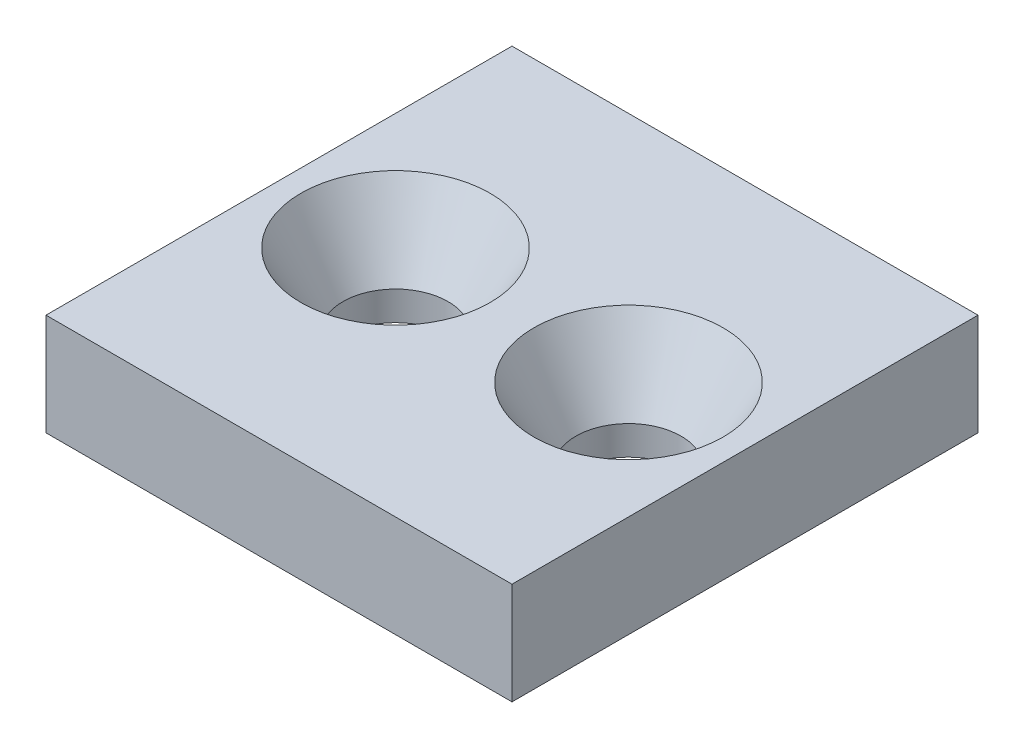
ISO-10303-21;
HEADER;
FILE_DESCRIPTION(('STEP AP214'),'2;1');
FILE_NAME('part.step','',(''),(''),'','','');
FILE_SCHEMA(('AUTOMOTIVE_DESIGN { 1 0 10303 214 1 1 1 1 }'));
ENDSEC;
DATA;
#1=APPLICATION_CONTEXT('core data for automotive mechanical design processes');
#2=APPLICATION_PROTOCOL_DEFINITION('international standard','automotive_design',2000,#1);
#3=PRODUCT_CONTEXT('',#1,'mechanical');
#4=PRODUCT('Part','Part','',(#3));
#5=PRODUCT_RELATED_PRODUCT_CATEGORY('part','',(#4));
#6=PRODUCT_DEFINITION_FORMATION('','',#4);
#7=PRODUCT_DEFINITION_CONTEXT('part definition',#1,'design');
#8=PRODUCT_DEFINITION('design','',#6,#7);
#9=PRODUCT_DEFINITION_SHAPE('','',#8);
#10=(LENGTH_UNIT() NAMED_UNIT(*) SI_UNIT(.MILLI.,.METRE.));
#11=(NAMED_UNIT(*) PLANE_ANGLE_UNIT() SI_UNIT($,.RADIAN.));
#12=(NAMED_UNIT(*) SI_UNIT($,.STERADIAN.) SOLID_ANGLE_UNIT());
#13=UNCERTAINTY_MEASURE_WITH_UNIT(LENGTH_MEASURE(1.E-05),#10,'distance_accuracy_value','');
#14=(GEOMETRIC_REPRESENTATION_CONTEXT(3) GLOBAL_UNCERTAINTY_ASSIGNED_CONTEXT((#13)) GLOBAL_UNIT_ASSIGNED_CONTEXT((#10,
#11,#12)) REPRESENTATION_CONTEXT('',''));
#15=CARTESIAN_POINT('',(0.,0.,0.));
#16=DIRECTION('',(0.,0.,1.));
#17=DIRECTION('',(1.,0.,0.));
#18=AXIS2_PLACEMENT_3D('',#15,#16,#17);
#19=CARTESIAN_POINT('',(16.,3.5,16.));
#20=DIRECTION('',(-1.,0.,0.));
#21=DIRECTION('',(0.,0.,1.));
#22=AXIS2_PLACEMENT_3D('',#19,#20,#21);
#23=PLANE('',#22);
#24=DIRECTION('',(0.,0.,-1.));
#25=VECTOR('',#24,1.);
#26=CARTESIAN_POINT('',(16.,-3.5,16.));
#27=LINE('',#26,#25);
#28=CARTESIAN_POINT('',(16.,-3.5,16.));
#29=VERTEX_POINT('',#28);
#30=CARTESIAN_POINT('',(16.,-3.5,-16.));
#31=VERTEX_POINT('',#30);
#32=EDGE_CURVE('E96',#29,#31,#27,.T.);
#33=ORIENTED_EDGE('',*,*,#32,.T.);
#34=DIRECTION('',(0.,-1.,0.));
#35=VECTOR('',#34,1.);
#36=CARTESIAN_POINT('',(16.,3.5,-16.));
#37=LINE('',#36,#35);
#38=CARTESIAN_POINT('',(16.,3.5,-16.));
#39=VERTEX_POINT('',#38);
#40=EDGE_CURVE('E11',#39,#31,#37,.T.);
#41=ORIENTED_EDGE('',*,*,#40,.F.);
#42=DIRECTION('',(0.,0.,-1.));
#43=VECTOR('',#42,1.);
#44=CARTESIAN_POINT('',(16.,3.5,16.));
#45=LINE('',#44,#43);
#46=CARTESIAN_POINT('',(16.,3.5,16.));
#47=VERTEX_POINT('',#46);
#48=EDGE_CURVE('E84',#47,#39,#45,.T.);
#49=ORIENTED_EDGE('',*,*,#48,.F.);
#50=DIRECTION('',(0.,-1.,0.));
#51=VECTOR('',#50,1.);
#52=CARTESIAN_POINT('',(16.,3.5,16.));
#53=LINE('',#52,#51);
#54=EDGE_CURVE('E92',#47,#29,#53,.T.);
#55=ORIENTED_EDGE('',*,*,#54,.T.);
#56=EDGE_LOOP('',(#33,#41,#49,#55));
#57=FACE_BOUND('',#56,.T.);
#58=ADVANCED_FACE('F33',(#57),#23,.F.);
#59=CARTESIAN_POINT('',(-16.,3.5,-16.));
#60=DIRECTION('',(0.,0.,1.));
#61=DIRECTION('',(1.,0.,0.));
#62=AXIS2_PLACEMENT_3D('',#59,#60,#61);
#63=PLANE('',#62);
#64=DIRECTION('',(-1.,0.,0.));
#65=VECTOR('',#64,1.);
#66=CARTESIAN_POINT('',(-16.,-3.5,-16.));
#67=LINE('',#66,#65);
#68=CARTESIAN_POINT('',(-16.,-3.5,-16.));
#69=VERTEX_POINT('',#68);
#70=EDGE_CURVE('E88',#31,#69,#67,.T.);
#71=ORIENTED_EDGE('',*,*,#70,.T.);
#72=DIRECTION('',(0.,-1.,0.));
#73=VECTOR('',#72,1.);
#74=CARTESIAN_POINT('',(-16.,3.5,-16.));
#75=LINE('',#74,#73);
#76=CARTESIAN_POINT('',(-16.,3.5,-16.));
#77=VERTEX_POINT('',#76);
#78=EDGE_CURVE('E41',#77,#69,#75,.T.);
#79=ORIENTED_EDGE('',*,*,#78,.F.);
#80=DIRECTION('',(-1.,0.,0.));
#81=VECTOR('',#80,1.);
#82=CARTESIAN_POINT('',(-16.,3.5,-16.));
#83=LINE('',#82,#81);
#84=EDGE_CURVE('E79',#39,#77,#83,.T.);
#85=ORIENTED_EDGE('',*,*,#84,.F.);
#86=ORIENTED_EDGE('',*,*,#40,.T.);
#87=EDGE_LOOP('',(#71,#79,#85,#86));
#88=FACE_BOUND('',#87,.T.);
#89=ADVANCED_FACE('F87',(#88),#63,.F.);
#90=CARTESIAN_POINT('',(-16.,3.5,16.));
#91=DIRECTION('',(1.,0.,0.));
#92=DIRECTION('',(0.,0.,-1.));
#93=AXIS2_PLACEMENT_3D('',#90,#91,#92);
#94=PLANE('',#93);
#95=DIRECTION('',(0.,0.,1.));
#96=VECTOR('',#95,1.);
#97=CARTESIAN_POINT('',(-16.,-3.5,16.));
#98=LINE('',#97,#96);
#99=CARTESIAN_POINT('',(-16.,-3.5,16.));
#100=VERTEX_POINT('',#99);
#101=EDGE_CURVE('E66',#69,#100,#98,.T.);
#102=ORIENTED_EDGE('',*,*,#101,.T.);
#103=DIRECTION('',(0.,-1.,0.));
#104=VECTOR('',#103,1.);
#105=CARTESIAN_POINT('',(-16.,3.5,16.));
#106=LINE('',#105,#104);
#107=CARTESIAN_POINT('',(-16.,3.5,16.));
#108=VERTEX_POINT('',#107);
#109=EDGE_CURVE('E89',#108,#100,#106,.T.);
#110=ORIENTED_EDGE('',*,*,#109,.F.);
#111=DIRECTION('',(0.,0.,1.));
#112=VECTOR('',#111,1.);
#113=CARTESIAN_POINT('',(-16.,3.5,16.));
#114=LINE('',#113,#112);
#115=EDGE_CURVE('E82',#77,#108,#114,.T.);
#116=ORIENTED_EDGE('',*,*,#115,.F.);
#117=ORIENTED_EDGE('',*,*,#78,.T.);
#118=EDGE_LOOP('',(#102,#110,#116,#117));
#119=FACE_BOUND('',#118,.T.);
#120=ADVANCED_FACE('F90',(#119),#94,.F.);
#121=CARTESIAN_POINT('',(-16.,3.5,16.));
#122=DIRECTION('',(0.,0.,-1.));
#123=DIRECTION('',(-1.,0.,0.));
#124=AXIS2_PLACEMENT_3D('',#121,#122,#123);
#125=PLANE('',#124);
#126=DIRECTION('',(1.,0.,0.));
#127=VECTOR('',#126,1.);
#128=CARTESIAN_POINT('',(-16.,-3.5,16.));
#129=LINE('',#128,#127);
#130=EDGE_CURVE('E72',#100,#29,#129,.T.);
#131=ORIENTED_EDGE('',*,*,#130,.T.);
#132=ORIENTED_EDGE('',*,*,#54,.F.);
#133=DIRECTION('',(1.,0.,0.));
#134=VECTOR('',#133,1.);
#135=CARTESIAN_POINT('',(-16.,3.5,16.));
#136=LINE('',#135,#134);
#137=EDGE_CURVE('E49',#108,#47,#136,.T.);
#138=ORIENTED_EDGE('',*,*,#137,.F.);
#139=ORIENTED_EDGE('',*,*,#109,.T.);
#140=EDGE_LOOP('',(#131,#132,#138,#139));
#141=FACE_BOUND('',#140,.T.);
#142=ADVANCED_FACE('F104',(#141),#125,.F.);
#143=CARTESIAN_POINT('',(0.,3.5,0.));
#144=DIRECTION('',(0.,-1.,0.));
#145=DIRECTION('',(0.,0.,-1.));
#146=AXIS2_PLACEMENT_3D('',#143,#144,#145);
#147=PLANE('',#146);
#148=CARTESIAN_POINT('',(-8.,3.5,0.));
#149=DIRECTION('',(0.,-1.,0.));
#150=DIRECTION('',(0.,0.,1.));
#151=AXIS2_PLACEMENT_3D('',#148,#149,#150);
#152=CIRCLE('',#151,6.5);
#153=CARTESIAN_POINT('',(-8.,3.5,6.5));
#154=VERTEX_POINT('',#153);
#155=EDGE_CURVE('E124',#154,#154,#152,.T.);
#156=ORIENTED_EDGE('',*,*,#155,.T.);
#157=EDGE_LOOP('',(#156));
#158=FACE_BOUND('',#157,.T.);
#159=CARTESIAN_POINT('',(8.,3.5,0.));
#160=DIRECTION('',(0.,1.,0.));
#161=DIRECTION('',(0.,0.,1.));
#162=AXIS2_PLACEMENT_3D('',#159,#160,#161);
#163=CIRCLE('',#162,6.5);
#164=CARTESIAN_POINT('',(8.,3.5,6.5));
#165=VERTEX_POINT('',#164);
#166=EDGE_CURVE('E115',#165,#165,#163,.T.);
#167=ORIENTED_EDGE('',*,*,#166,.F.);
#168=EDGE_LOOP('',(#167));
#169=FACE_BOUND('',#168,.T.);
#170=ORIENTED_EDGE('',*,*,#48,.T.);
#171=ORIENTED_EDGE('',*,*,#84,.T.);
#172=ORIENTED_EDGE('',*,*,#115,.T.);
#173=ORIENTED_EDGE('',*,*,#137,.T.);
#174=EDGE_LOOP('',(#170,#171,#172,#173));
#175=FACE_BOUND('',#174,.T.);
#176=ADVANCED_FACE('F80',(#158,#169,#175),#147,.F.);
#177=CARTESIAN_POINT('',(0.,-3.5,0.));
#178=DIRECTION('',(0.,-1.,0.));
#179=DIRECTION('',(0.,0.,-1.));
#180=AXIS2_PLACEMENT_3D('',#177,#178,#179);
#181=PLANE('',#180);
#182=CARTESIAN_POINT('',(-8.,-3.5,0.));
#183=DIRECTION('',(0.,-1.,0.));
#184=DIRECTION('',(0.,0.,1.));
#185=AXIS2_PLACEMENT_3D('',#182,#183,#184);
#186=CIRCLE('',#185,3.61324865405184);
#187=CARTESIAN_POINT('',(-8.,-3.5,3.61324865405184));
#188=VERTEX_POINT('',#187);
#189=EDGE_CURVE('E121',#188,#188,#186,.T.);
#190=ORIENTED_EDGE('',*,*,#189,.F.);
#191=EDGE_LOOP('',(#190));
#192=FACE_BOUND('',#191,.T.);
#193=CARTESIAN_POINT('',(8.,-3.5,0.));
#194=DIRECTION('',(0.,1.,0.));
#195=DIRECTION('',(0.,0.,1.));
#196=AXIS2_PLACEMENT_3D('',#193,#194,#195);
#197=CIRCLE('',#196,3.61324865405184);
#198=CARTESIAN_POINT('',(8.,-3.5,3.61324865405184));
#199=VERTEX_POINT('',#198);
#200=EDGE_CURVE('E112',#199,#199,#197,.T.);
#201=ORIENTED_EDGE('',*,*,#200,.T.);
#202=EDGE_LOOP('',(#201));
#203=FACE_BOUND('',#202,.T.);
#204=ORIENTED_EDGE('',*,*,#32,.F.);
#205=ORIENTED_EDGE('',*,*,#130,.F.);
#206=ORIENTED_EDGE('',*,*,#101,.F.);
#207=ORIENTED_EDGE('',*,*,#70,.F.);
#208=EDGE_LOOP('',(#204,#205,#206,#207));
#209=FACE_BOUND('',#208,.T.);
#210=ADVANCED_FACE('F107',(#192,#203,#209),#181,.T.);
#211=CARTESIAN_POINT('',(8.,-1.5,0.));
#212=DIRECTION('',(0.,1.,0.));
#213=DIRECTION('',(0.,0.,1.));
#214=AXIS2_PLACEMENT_3D('',#211,#212,#213);
#215=CONICAL_SURFACE('',#214,3.61324865405184,0.523598775598303);
#216=ORIENTED_EDGE('',*,*,#166,.T.);
#217=EDGE_LOOP('',(#216));
#218=FACE_BOUND('',#217,.T.);
#219=CARTESIAN_POINT('',(8.,-1.5,0.));
#220=DIRECTION('',(0.,1.,0.));
#221=DIRECTION('',(0.,0.,1.));
#222=AXIS2_PLACEMENT_3D('',#219,#220,#221);
#223=CIRCLE('',#222,3.61324865405184);
#224=CARTESIAN_POINT('',(8.,-1.5,3.61324865405184));
#225=VERTEX_POINT('',#224);
#226=EDGE_CURVE('E99',#225,#225,#223,.T.);
#227=ORIENTED_EDGE('',*,*,#226,.F.);
#228=EDGE_LOOP('',(#227));
#229=FACE_BOUND('',#228,.T.);
#230=ADVANCED_FACE('F145',(#218,#229),#215,.F.);
#231=CARTESIAN_POINT('',(8.,3.5,0.));
#232=DIRECTION('',(0.,1.,0.));
#233=DIRECTION('',(0.,0.,1.));
#234=AXIS2_PLACEMENT_3D('',#231,#232,#233);
#235=CYLINDRICAL_SURFACE('',#234,3.61324865405184);
#236=ORIENTED_EDGE('',*,*,#226,.T.);
#237=EDGE_LOOP('',(#236));
#238=FACE_BOUND('',#237,.T.);
#239=ORIENTED_EDGE('',*,*,#200,.F.);
#240=EDGE_LOOP('',(#239));
#241=FACE_BOUND('',#240,.T.);
#242=ADVANCED_FACE('F134',(#238,#241),#235,.F.);
#243=CARTESIAN_POINT('',(-8.,-1.5,0.));
#244=DIRECTION('',(0.,1.,0.));
#245=DIRECTION('',(0.,0.,1.));
#246=AXIS2_PLACEMENT_3D('',#243,#244,#245);
#247=CONICAL_SURFACE('',#246,3.61324865405184,0.523598775598303);
#248=ORIENTED_EDGE('',*,*,#155,.F.);
#249=EDGE_LOOP('',(#248));
#250=FACE_BOUND('',#249,.T.);
#251=CARTESIAN_POINT('',(-8.,-1.5,0.));
#252=DIRECTION('',(0.,-1.,0.));
#253=DIRECTION('',(0.,0.,1.));
#254=AXIS2_PLACEMENT_3D('',#251,#252,#253);
#255=CIRCLE('',#254,3.61324865405184);
#256=CARTESIAN_POINT('',(-8.,-1.5,3.61324865405184));
#257=VERTEX_POINT('',#256);
#258=EDGE_CURVE('E118',#257,#257,#255,.T.);
#259=ORIENTED_EDGE('',*,*,#258,.T.);
#260=EDGE_LOOP('',(#259));
#261=FACE_BOUND('',#260,.T.);
#262=ADVANCED_FACE('F130',(#250,#261),#247,.F.);
#263=CARTESIAN_POINT('',(-8.,3.5,0.));
#264=DIRECTION('',(0.,1.,0.));
#265=DIRECTION('',(0.,0.,1.));
#266=AXIS2_PLACEMENT_3D('',#263,#264,#265);
#267=CYLINDRICAL_SURFACE('',#266,3.61324865405184);
#268=ORIENTED_EDGE('',*,*,#258,.F.);
#269=EDGE_LOOP('',(#268));
#270=FACE_BOUND('',#269,.T.);
#271=ORIENTED_EDGE('',*,*,#189,.T.);
#272=EDGE_LOOP('',(#271));
#273=FACE_BOUND('',#272,.T.);
#274=ADVANCED_FACE('F133',(#270,#273),#267,.F.);
#275=CLOSED_SHELL('',(#58,#89,#120,#142,#176,#210,#230,#242,#262,#274));
#276=MANIFOLD_SOLID_BREP('B2',#275);
#277=ADVANCED_BREP_SHAPE_REPRESENTATION('',(#18,#276),#14);
#278=SHAPE_DEFINITION_REPRESENTATION(#9,#277);
ENDSEC;
END-ISO-10303-21;
